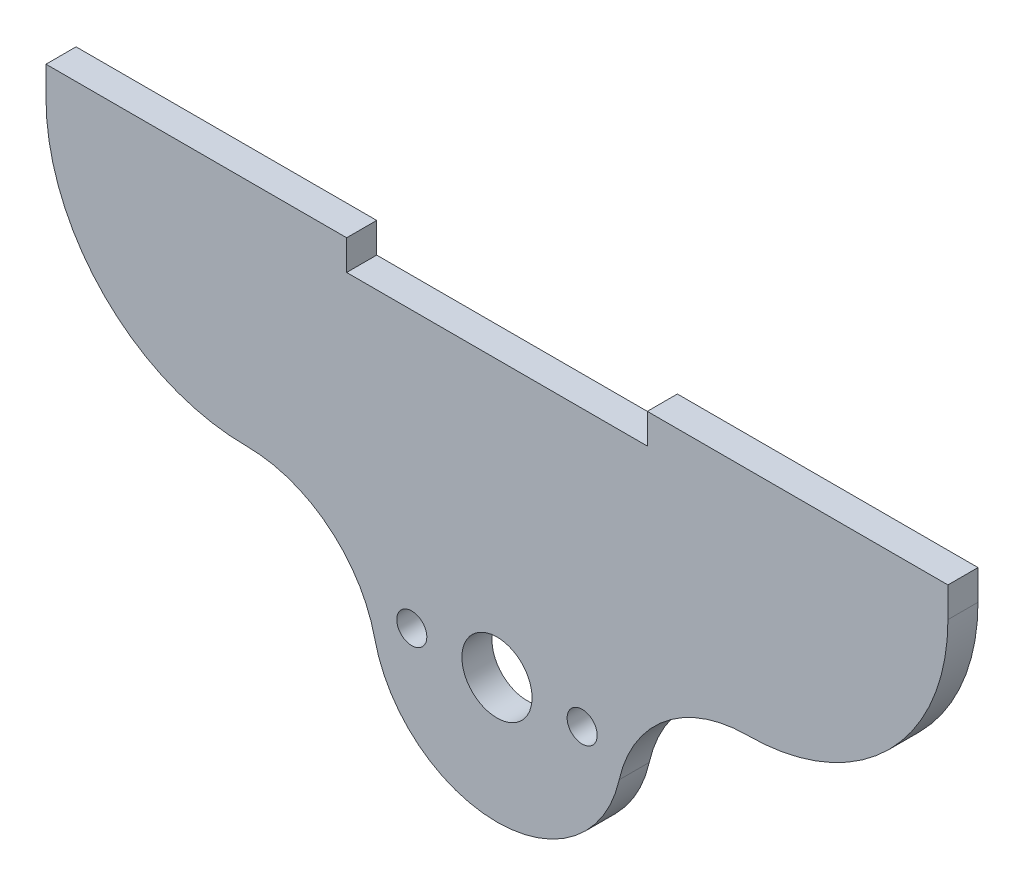
ISO-10303-21;
HEADER;
FILE_DESCRIPTION(('STEP AP214'),'2;1');
FILE_NAME('part.step','',(''),(''),'','','');
FILE_SCHEMA(('AUTOMOTIVE_DESIGN { 1 0 10303 214 1 1 1 1 }'));
ENDSEC;
DATA;
#1=APPLICATION_CONTEXT('core data for automotive mechanical design processes');
#2=APPLICATION_PROTOCOL_DEFINITION('international standard','automotive_design',2000,#1);
#3=PRODUCT_CONTEXT('',#1,'mechanical');
#4=PRODUCT('Part','Part','',(#3));
#5=PRODUCT_RELATED_PRODUCT_CATEGORY('part','',(#4));
#6=PRODUCT_DEFINITION_FORMATION('','',#4);
#7=PRODUCT_DEFINITION_CONTEXT('part definition',#1,'design');
#8=PRODUCT_DEFINITION('design','',#6,#7);
#9=PRODUCT_DEFINITION_SHAPE('','',#8);
#10=(LENGTH_UNIT() NAMED_UNIT(*) SI_UNIT(.MILLI.,.METRE.));
#11=(NAMED_UNIT(*) PLANE_ANGLE_UNIT() SI_UNIT($,.RADIAN.));
#12=(NAMED_UNIT(*) SI_UNIT($,.STERADIAN.) SOLID_ANGLE_UNIT());
#13=UNCERTAINTY_MEASURE_WITH_UNIT(LENGTH_MEASURE(1.E-05),#10,'distance_accuracy_value','');
#14=(GEOMETRIC_REPRESENTATION_CONTEXT(3) GLOBAL_UNCERTAINTY_ASSIGNED_CONTEXT((#13)) GLOBAL_UNIT_ASSIGNED_CONTEXT((#10,
#11,#12)) REPRESENTATION_CONTEXT('',''));
#15=CARTESIAN_POINT('',(0.,0.,0.));
#16=DIRECTION('',(0.,0.,1.));
#17=DIRECTION('',(1.,0.,0.));
#18=AXIS2_PLACEMENT_3D('',#15,#16,#17);
#19=CARTESIAN_POINT('',(-25.,27.5,3.));
#20=DIRECTION('',(0.,0.,1.));
#21=DIRECTION('',(1.,0.,0.));
#22=AXIS2_PLACEMENT_3D('',#19,#20,#21);
#23=PLANE('',#22);
#24=CARTESIAN_POINT('',(8.5,0.,3.));
#25=DIRECTION('',(0.,0.,1.));
#26=DIRECTION('',(1.,0.,0.));
#27=AXIS2_PLACEMENT_3D('',#24,#25,#26);
#28=CIRCLE('',#27,1.5);
#29=CARTESIAN_POINT('',(10.,0.,3.));
#30=VERTEX_POINT('',#29);
#31=EDGE_CURVE('E296',#30,#30,#28,.T.);
#32=ORIENTED_EDGE('',*,*,#31,.F.);
#33=EDGE_LOOP('',(#32));
#34=FACE_BOUND('',#33,.T.);
#35=CARTESIAN_POINT('',(-25.,27.5,3.));
#36=DIRECTION('',(0.,0.,1.));
#37=DIRECTION('',(1.,0.,0.));
#38=AXIS2_PLACEMENT_3D('',#35,#36,#37);
#39=CIRCLE('',#38,20.);
#40=CARTESIAN_POINT('',(-45.,27.5,3.));
#41=VERTEX_POINT('',#40);
#42=CARTESIAN_POINT('',(-25.,7.5,3.));
#43=VERTEX_POINT('',#42);
#44=EDGE_CURVE('E187',#41,#43,#39,.T.);
#45=ORIENTED_EDGE('',*,*,#44,.T.);
#46=CARTESIAN_POINT('',(-25.,-5.625,3.));
#47=DIRECTION('',(0.,0.,-1.));
#48=DIRECTION('',(1.,0.,0.));
#49=AXIS2_PLACEMENT_3D('',#46,#47,#48);
#50=CIRCLE('',#49,13.125);
#51=CARTESIAN_POINT('',(-12.1951219512195,-2.74390243902439,3.));
#52=VERTEX_POINT('',#51);
#53=EDGE_CURVE('E115',#43,#52,#50,.T.);
#54=ORIENTED_EDGE('',*,*,#53,.T.);
#55=CARTESIAN_POINT('',(0.,0.,3.));
#56=DIRECTION('',(0.,0.,1.));
#57=DIRECTION('',(1.,0.,0.));
#58=AXIS2_PLACEMENT_3D('',#55,#56,#57);
#59=CIRCLE('',#58,12.5);
#60=CARTESIAN_POINT('',(12.1951219512195,-2.74390243902439,3.));
#61=VERTEX_POINT('',#60);
#62=EDGE_CURVE('E214',#52,#61,#59,.T.);
#63=ORIENTED_EDGE('',*,*,#62,.T.);
#64=CARTESIAN_POINT('',(25.,-5.625,3.));
#65=DIRECTION('',(0.,0.,-1.));
#66=DIRECTION('',(-1.,0.,0.));
#67=AXIS2_PLACEMENT_3D('',#64,#65,#66);
#68=CIRCLE('',#67,13.125);
#69=CARTESIAN_POINT('',(25.,7.5,3.));
#70=VERTEX_POINT('',#69);
#71=EDGE_CURVE('E233',#61,#70,#68,.T.);
#72=ORIENTED_EDGE('',*,*,#71,.T.);
#73=CARTESIAN_POINT('',(25.,27.5,3.));
#74=DIRECTION('',(0.,0.,1.));
#75=DIRECTION('',(1.,0.,0.));
#76=AXIS2_PLACEMENT_3D('',#73,#74,#75);
#77=CIRCLE('',#76,20.);
#78=CARTESIAN_POINT('',(45.,27.5,3.));
#79=VERTEX_POINT('',#78);
#80=EDGE_CURVE('E230',#70,#79,#77,.T.);
#81=ORIENTED_EDGE('',*,*,#80,.T.);
#82=DIRECTION('',(0.,1.,0.));
#83=VECTOR('',#82,1.);
#84=CARTESIAN_POINT('',(45.,27.5,3.));
#85=LINE('',#84,#83);
#86=CARTESIAN_POINT('',(45.,30.5,3.));
#87=VERTEX_POINT('',#86);
#88=EDGE_CURVE('E232',#79,#87,#85,.T.);
#89=ORIENTED_EDGE('',*,*,#88,.T.);
#90=DIRECTION('',(-1.,0.,0.));
#91=VECTOR('',#90,1.);
#92=CARTESIAN_POINT('',(45.,30.5,3.));
#93=LINE('',#92,#91);
#94=CARTESIAN_POINT('',(15.,30.5,3.));
#95=VERTEX_POINT('',#94);
#96=EDGE_CURVE('E235',#87,#95,#93,.T.);
#97=ORIENTED_EDGE('',*,*,#96,.T.);
#98=DIRECTION('',(0.,-1.,0.));
#99=VECTOR('',#98,1.);
#100=CARTESIAN_POINT('',(15.,27.5,3.));
#101=LINE('',#100,#99);
#102=CARTESIAN_POINT('',(15.,27.5,3.));
#103=VERTEX_POINT('',#102);
#104=EDGE_CURVE('E241',#95,#103,#101,.T.);
#105=ORIENTED_EDGE('',*,*,#104,.T.);
#106=DIRECTION('',(-1.,0.,0.));
#107=VECTOR('',#106,1.);
#108=CARTESIAN_POINT('',(-15.,27.5,3.));
#109=LINE('',#108,#107);
#110=CARTESIAN_POINT('',(-15.,27.5,3.));
#111=VERTEX_POINT('',#110);
#112=EDGE_CURVE('E146',#103,#111,#109,.T.);
#113=ORIENTED_EDGE('',*,*,#112,.T.);
#114=DIRECTION('',(0.,1.,0.));
#115=VECTOR('',#114,1.);
#116=CARTESIAN_POINT('',(-15.,27.5,3.));
#117=LINE('',#116,#115);
#118=CARTESIAN_POINT('',(-15.,30.5,3.));
#119=VERTEX_POINT('',#118);
#120=EDGE_CURVE('E140',#111,#119,#117,.T.);
#121=ORIENTED_EDGE('',*,*,#120,.T.);
#122=DIRECTION('',(-1.,0.,0.));
#123=VECTOR('',#122,1.);
#124=CARTESIAN_POINT('',(-45.,30.5,3.));
#125=LINE('',#124,#123);
#126=CARTESIAN_POINT('',(-45.,30.5,3.));
#127=VERTEX_POINT('',#126);
#128=EDGE_CURVE('E144',#119,#127,#125,.T.);
#129=ORIENTED_EDGE('',*,*,#128,.T.);
#130=DIRECTION('',(0.,-1.,0.));
#131=VECTOR('',#130,1.);
#132=CARTESIAN_POINT('',(-45.,27.5,3.));
#133=LINE('',#132,#131);
#134=EDGE_CURVE('E60',#127,#41,#133,.T.);
#135=ORIENTED_EDGE('',*,*,#134,.T.);
#136=EDGE_LOOP('',(#45,#54,#63,#72,#81,#89,#97,#105,#113,#121,#129,#135));
#137=FACE_BOUND('',#136,.T.);
#138=CARTESIAN_POINT('',(-8.5,0.,3.));
#139=DIRECTION('',(0.,0.,1.));
#140=DIRECTION('',(1.,0.,0.));
#141=AXIS2_PLACEMENT_3D('',#138,#139,#140);
#142=CIRCLE('',#141,1.5);
#143=CARTESIAN_POINT('',(-7.,0.,3.));
#144=VERTEX_POINT('',#143);
#145=EDGE_CURVE('E168',#144,#144,#142,.T.);
#146=ORIENTED_EDGE('',*,*,#145,.F.);
#147=EDGE_LOOP('',(#146));
#148=FACE_BOUND('',#147,.T.);
#149=CARTESIAN_POINT('',(0.,0.,3.));
#150=DIRECTION('',(0.,0.,1.));
#151=DIRECTION('',(1.,0.,0.));
#152=AXIS2_PLACEMENT_3D('',#149,#150,#151);
#153=CIRCLE('',#152,3.5);
#154=CARTESIAN_POINT('',(3.5,0.,3.));
#155=VERTEX_POINT('',#154);
#156=EDGE_CURVE('E287',#155,#155,#153,.T.);
#157=ORIENTED_EDGE('',*,*,#156,.F.);
#158=EDGE_LOOP('',(#157));
#159=FACE_BOUND('',#158,.T.);
#160=ADVANCED_FACE('F43',(#34,#137,#148,#159),#23,.T.);
#161=CARTESIAN_POINT('',(-25.,27.5,0.));
#162=DIRECTION('',(0.,0.,1.));
#163=DIRECTION('',(1.,0.,0.));
#164=AXIS2_PLACEMENT_3D('',#161,#162,#163);
#165=PLANE('',#164);
#166=CARTESIAN_POINT('',(-25.,27.5,0.));
#167=DIRECTION('',(0.,0.,1.));
#168=DIRECTION('',(1.,0.,0.));
#169=AXIS2_PLACEMENT_3D('',#166,#167,#168);
#170=CIRCLE('',#169,20.);
#171=CARTESIAN_POINT('',(-45.,27.5,0.));
#172=VERTEX_POINT('',#171);
#173=CARTESIAN_POINT('',(-25.,7.5,0.));
#174=VERTEX_POINT('',#173);
#175=EDGE_CURVE('E164',#172,#174,#170,.T.);
#176=ORIENTED_EDGE('',*,*,#175,.F.);
#177=DIRECTION('',(0.,-1.,0.));
#178=VECTOR('',#177,1.);
#179=CARTESIAN_POINT('',(-45.,27.5,0.));
#180=LINE('',#179,#178);
#181=CARTESIAN_POINT('',(-45.,30.5,0.));
#182=VERTEX_POINT('',#181);
#183=EDGE_CURVE('E107',#182,#172,#180,.T.);
#184=ORIENTED_EDGE('',*,*,#183,.F.);
#185=DIRECTION('',(-1.,0.,0.));
#186=VECTOR('',#185,1.);
#187=CARTESIAN_POINT('',(-45.,30.5,0.));
#188=LINE('',#187,#186);
#189=CARTESIAN_POINT('',(-15.,30.5,0.));
#190=VERTEX_POINT('',#189);
#191=EDGE_CURVE('E101',#190,#182,#188,.T.);
#192=ORIENTED_EDGE('',*,*,#191,.F.);
#193=DIRECTION('',(0.,1.,0.));
#194=VECTOR('',#193,1.);
#195=CARTESIAN_POINT('',(-15.,27.5,0.));
#196=LINE('',#195,#194);
#197=CARTESIAN_POINT('',(-15.,27.5,0.));
#198=VERTEX_POINT('',#197);
#199=EDGE_CURVE('E154',#198,#190,#196,.T.);
#200=ORIENTED_EDGE('',*,*,#199,.F.);
#201=DIRECTION('',(-1.,0.,0.));
#202=VECTOR('',#201,1.);
#203=CARTESIAN_POINT('',(-15.,27.5,0.));
#204=LINE('',#203,#202);
#205=CARTESIAN_POINT('',(15.,27.5,0.));
#206=VERTEX_POINT('',#205);
#207=EDGE_CURVE('E182',#206,#198,#204,.T.);
#208=ORIENTED_EDGE('',*,*,#207,.F.);
#209=DIRECTION('',(0.,-1.,0.));
#210=VECTOR('',#209,1.);
#211=CARTESIAN_POINT('',(15.,27.5,0.));
#212=LINE('',#211,#210);
#213=CARTESIAN_POINT('',(15.,30.5,0.));
#214=VERTEX_POINT('',#213);
#215=EDGE_CURVE('E180',#214,#206,#212,.T.);
#216=ORIENTED_EDGE('',*,*,#215,.F.);
#217=DIRECTION('',(-1.,0.,0.));
#218=VECTOR('',#217,1.);
#219=CARTESIAN_POINT('',(45.,30.5,0.));
#220=LINE('',#219,#218);
#221=CARTESIAN_POINT('',(45.,30.5,0.));
#222=VERTEX_POINT('',#221);
#223=EDGE_CURVE('E178',#222,#214,#220,.T.);
#224=ORIENTED_EDGE('',*,*,#223,.F.);
#225=DIRECTION('',(0.,1.,0.));
#226=VECTOR('',#225,1.);
#227=CARTESIAN_POINT('',(45.,27.5,0.));
#228=LINE('',#227,#226);
#229=CARTESIAN_POINT('',(45.,27.5,0.));
#230=VERTEX_POINT('',#229);
#231=EDGE_CURVE('E176',#230,#222,#228,.T.);
#232=ORIENTED_EDGE('',*,*,#231,.F.);
#233=CARTESIAN_POINT('',(25.,27.5,0.));
#234=DIRECTION('',(0.,0.,1.));
#235=DIRECTION('',(1.,0.,0.));
#236=AXIS2_PLACEMENT_3D('',#233,#234,#235);
#237=CIRCLE('',#236,20.);
#238=CARTESIAN_POINT('',(25.,7.5,0.));
#239=VERTEX_POINT('',#238);
#240=EDGE_CURVE('E174',#239,#230,#237,.T.);
#241=ORIENTED_EDGE('',*,*,#240,.F.);
#242=CARTESIAN_POINT('',(25.,-5.625,0.));
#243=DIRECTION('',(0.,0.,-1.));
#244=DIRECTION('',(-1.,0.,0.));
#245=AXIS2_PLACEMENT_3D('',#242,#243,#244);
#246=CIRCLE('',#245,13.125);
#247=CARTESIAN_POINT('',(12.1951219512195,-2.74390243902439,0.));
#248=VERTEX_POINT('',#247);
#249=EDGE_CURVE('E172',#248,#239,#246,.T.);
#250=ORIENTED_EDGE('',*,*,#249,.F.);
#251=CARTESIAN_POINT('',(0.,0.,0.));
#252=DIRECTION('',(0.,0.,1.));
#253=DIRECTION('',(1.,0.,0.));
#254=AXIS2_PLACEMENT_3D('',#251,#252,#253);
#255=CIRCLE('',#254,12.5);
#256=CARTESIAN_POINT('',(-12.1951219512195,-2.74390243902439,0.));
#257=VERTEX_POINT('',#256);
#258=EDGE_CURVE('E170',#257,#248,#255,.T.);
#259=ORIENTED_EDGE('',*,*,#258,.F.);
#260=CARTESIAN_POINT('',(-25.,-5.625,0.));
#261=DIRECTION('',(0.,0.,-1.));
#262=DIRECTION('',(1.,0.,0.));
#263=AXIS2_PLACEMENT_3D('',#260,#261,#262);
#264=CIRCLE('',#263,13.125);
#265=EDGE_CURVE('E167',#174,#257,#264,.T.);
#266=ORIENTED_EDGE('',*,*,#265,.F.);
#267=EDGE_LOOP('',(#176,#184,#192,#200,#208,#216,#224,#232,#241,#250,#259,#266));
#268=FACE_BOUND('',#267,.T.);
#269=CARTESIAN_POINT('',(-8.5,0.,0.));
#270=DIRECTION('',(0.,0.,1.));
#271=DIRECTION('',(1.,0.,0.));
#272=AXIS2_PLACEMENT_3D('',#269,#270,#271);
#273=CIRCLE('',#272,1.5);
#274=CARTESIAN_POINT('',(-7.,0.,0.));
#275=VERTEX_POINT('',#274);
#276=EDGE_CURVE('E299',#275,#275,#273,.T.);
#277=ORIENTED_EDGE('',*,*,#276,.T.);
#278=EDGE_LOOP('',(#277));
#279=FACE_BOUND('',#278,.T.);
#280=CARTESIAN_POINT('',(8.5,0.,0.));
#281=DIRECTION('',(0.,0.,1.));
#282=DIRECTION('',(1.,0.,0.));
#283=AXIS2_PLACEMENT_3D('',#280,#281,#282);
#284=CIRCLE('',#283,1.5);
#285=CARTESIAN_POINT('',(10.,0.,0.));
#286=VERTEX_POINT('',#285);
#287=EDGE_CURVE('E293',#286,#286,#284,.T.);
#288=ORIENTED_EDGE('',*,*,#287,.T.);
#289=EDGE_LOOP('',(#288));
#290=FACE_BOUND('',#289,.T.);
#291=CARTESIAN_POINT('',(0.,0.,0.));
#292=DIRECTION('',(0.,0.,1.));
#293=DIRECTION('',(1.,0.,0.));
#294=AXIS2_PLACEMENT_3D('',#291,#292,#293);
#295=CIRCLE('',#294,3.5);
#296=CARTESIAN_POINT('',(3.5,0.,0.));
#297=VERTEX_POINT('',#296);
#298=EDGE_CURVE('E290',#297,#297,#295,.T.);
#299=ORIENTED_EDGE('',*,*,#298,.T.);
#300=EDGE_LOOP('',(#299));
#301=FACE_BOUND('',#300,.T.);
#302=ADVANCED_FACE('F218',(#268,#279,#290,#301),#165,.F.);
#303=CARTESIAN_POINT('',(-25.,27.5,3.));
#304=DIRECTION('',(0.,0.,-1.));
#305=DIRECTION('',(-1.,0.,0.));
#306=AXIS2_PLACEMENT_3D('',#303,#304,#305);
#307=CYLINDRICAL_SURFACE('',#306,20.);
#308=ORIENTED_EDGE('',*,*,#175,.T.);
#309=DIRECTION('',(0.,0.,-1.));
#310=VECTOR('',#309,1.);
#311=CARTESIAN_POINT('',(-25.,7.5,3.));
#312=LINE('',#311,#310);
#313=EDGE_CURVE('E13',#43,#174,#312,.T.);
#314=ORIENTED_EDGE('',*,*,#313,.F.);
#315=ORIENTED_EDGE('',*,*,#44,.F.);
#316=DIRECTION('',(0.,0.,-1.));
#317=VECTOR('',#316,1.);
#318=CARTESIAN_POINT('',(-45.,27.5,3.));
#319=LINE('',#318,#317);
#320=EDGE_CURVE('E160',#41,#172,#319,.T.);
#321=ORIENTED_EDGE('',*,*,#320,.T.);
#322=EDGE_LOOP('',(#308,#314,#315,#321));
#323=FACE_BOUND('',#322,.T.);
#324=ADVANCED_FACE('F45',(#323),#307,.T.);
#325=CARTESIAN_POINT('',(-25.,-5.625,3.));
#326=DIRECTION('',(0.,0.,-1.));
#327=DIRECTION('',(-1.,0.,0.));
#328=AXIS2_PLACEMENT_3D('',#325,#326,#327);
#329=CYLINDRICAL_SURFACE('',#328,13.125);
#330=ORIENTED_EDGE('',*,*,#265,.T.);
#331=DIRECTION('',(0.,0.,-1.));
#332=VECTOR('',#331,1.);
#333=CARTESIAN_POINT('',(-12.1951219512195,-2.74390243902439,3.));
#334=LINE('',#333,#332);
#335=EDGE_CURVE('E52',#52,#257,#334,.T.);
#336=ORIENTED_EDGE('',*,*,#335,.F.);
#337=ORIENTED_EDGE('',*,*,#53,.F.);
#338=ORIENTED_EDGE('',*,*,#313,.T.);
#339=EDGE_LOOP('',(#330,#336,#337,#338));
#340=FACE_BOUND('',#339,.T.);
#341=ADVANCED_FACE('F401',(#340),#329,.F.);
#342=CARTESIAN_POINT('',(0.,0.,3.));
#343=DIRECTION('',(0.,0.,-1.));
#344=DIRECTION('',(-1.,0.,0.));
#345=AXIS2_PLACEMENT_3D('',#342,#343,#344);
#346=CYLINDRICAL_SURFACE('',#345,12.5);
#347=ORIENTED_EDGE('',*,*,#258,.T.);
#348=DIRECTION('',(0.,0.,-1.));
#349=VECTOR('',#348,1.);
#350=CARTESIAN_POINT('',(12.1951219512195,-2.74390243902439,3.));
#351=LINE('',#350,#349);
#352=EDGE_CURVE('E206',#61,#248,#351,.T.);
#353=ORIENTED_EDGE('',*,*,#352,.F.);
#354=ORIENTED_EDGE('',*,*,#62,.F.);
#355=ORIENTED_EDGE('',*,*,#335,.T.);
#356=EDGE_LOOP('',(#347,#353,#354,#355));
#357=FACE_BOUND('',#356,.T.);
#358=ADVANCED_FACE('F212',(#357),#346,.T.);
#359=CARTESIAN_POINT('',(25.,-5.625,3.));
#360=DIRECTION('',(0.,0.,-1.));
#361=DIRECTION('',(-1.,0.,0.));
#362=AXIS2_PLACEMENT_3D('',#359,#360,#361);
#363=CYLINDRICAL_SURFACE('',#362,13.125);
#364=ORIENTED_EDGE('',*,*,#249,.T.);
#365=DIRECTION('',(0.,0.,-1.));
#366=VECTOR('',#365,1.);
#367=CARTESIAN_POINT('',(25.,7.5,3.));
#368=LINE('',#367,#366);
#369=EDGE_CURVE('E203',#70,#239,#368,.T.);
#370=ORIENTED_EDGE('',*,*,#369,.F.);
#371=ORIENTED_EDGE('',*,*,#71,.F.);
#372=ORIENTED_EDGE('',*,*,#352,.T.);
#373=EDGE_LOOP('',(#364,#370,#371,#372));
#374=FACE_BOUND('',#373,.T.);
#375=ADVANCED_FACE('F224',(#374),#363,.F.);
#376=CARTESIAN_POINT('',(25.,27.5,3.));
#377=DIRECTION('',(0.,0.,-1.));
#378=DIRECTION('',(-1.,0.,0.));
#379=AXIS2_PLACEMENT_3D('',#376,#377,#378);
#380=CYLINDRICAL_SURFACE('',#379,20.);
#381=ORIENTED_EDGE('',*,*,#240,.T.);
#382=DIRECTION('',(0.,0.,-1.));
#383=VECTOR('',#382,1.);
#384=CARTESIAN_POINT('',(45.,27.5,3.));
#385=LINE('',#384,#383);
#386=EDGE_CURVE('E200',#79,#230,#385,.T.);
#387=ORIENTED_EDGE('',*,*,#386,.F.);
#388=ORIENTED_EDGE('',*,*,#80,.F.);
#389=ORIENTED_EDGE('',*,*,#369,.T.);
#390=EDGE_LOOP('',(#381,#387,#388,#389));
#391=FACE_BOUND('',#390,.T.);
#392=ADVANCED_FACE('F228',(#391),#380,.T.);
#393=CARTESIAN_POINT('',(45.,27.5,3.));
#394=DIRECTION('',(-1.,0.,0.));
#395=DIRECTION('',(0.,0.,1.));
#396=AXIS2_PLACEMENT_3D('',#393,#394,#395);
#397=PLANE('',#396);
#398=ORIENTED_EDGE('',*,*,#231,.T.);
#399=DIRECTION('',(0.,0.,-1.));
#400=VECTOR('',#399,1.);
#401=CARTESIAN_POINT('',(45.,30.5,3.));
#402=LINE('',#401,#400);
#403=EDGE_CURVE('E197',#87,#222,#402,.T.);
#404=ORIENTED_EDGE('',*,*,#403,.F.);
#405=ORIENTED_EDGE('',*,*,#88,.F.);
#406=ORIENTED_EDGE('',*,*,#386,.T.);
#407=EDGE_LOOP('',(#398,#404,#405,#406));
#408=FACE_BOUND('',#407,.T.);
#409=ADVANCED_FACE('F366',(#408),#397,.F.);
#410=CARTESIAN_POINT('',(45.,30.5,3.));
#411=DIRECTION('',(0.,-1.,0.));
#412=DIRECTION('',(0.,0.,-1.));
#413=AXIS2_PLACEMENT_3D('',#410,#411,#412);
#414=PLANE('',#413);
#415=ORIENTED_EDGE('',*,*,#223,.T.);
#416=DIRECTION('',(0.,0.,-1.));
#417=VECTOR('',#416,1.);
#418=CARTESIAN_POINT('',(15.,30.5,3.));
#419=LINE('',#418,#417);
#420=EDGE_CURVE('E194',#95,#214,#419,.T.);
#421=ORIENTED_EDGE('',*,*,#420,.F.);
#422=ORIENTED_EDGE('',*,*,#96,.F.);
#423=ORIENTED_EDGE('',*,*,#403,.T.);
#424=EDGE_LOOP('',(#415,#421,#422,#423));
#425=FACE_BOUND('',#424,.T.);
#426=ADVANCED_FACE('F357',(#425),#414,.F.);
#427=CARTESIAN_POINT('',(15.,27.5,3.));
#428=DIRECTION('',(1.,0.,0.));
#429=DIRECTION('',(0.,0.,-1.));
#430=AXIS2_PLACEMENT_3D('',#427,#428,#429);
#431=PLANE('',#430);
#432=ORIENTED_EDGE('',*,*,#215,.T.);
#433=DIRECTION('',(0.,0.,-1.));
#434=VECTOR('',#433,1.);
#435=CARTESIAN_POINT('',(15.,27.5,3.));
#436=LINE('',#435,#434);
#437=EDGE_CURVE('E191',#103,#206,#436,.T.);
#438=ORIENTED_EDGE('',*,*,#437,.F.);
#439=ORIENTED_EDGE('',*,*,#104,.F.);
#440=ORIENTED_EDGE('',*,*,#420,.T.);
#441=EDGE_LOOP('',(#432,#438,#439,#440));
#442=FACE_BOUND('',#441,.T.);
#443=ADVANCED_FACE('F247',(#442),#431,.F.);
#444=CARTESIAN_POINT('',(-15.,27.5,3.));
#445=DIRECTION('',(0.,-1.,0.));
#446=DIRECTION('',(0.,0.,-1.));
#447=AXIS2_PLACEMENT_3D('',#444,#445,#446);
#448=PLANE('',#447);
#449=ORIENTED_EDGE('',*,*,#207,.T.);
#450=DIRECTION('',(0.,0.,-1.));
#451=VECTOR('',#450,1.);
#452=CARTESIAN_POINT('',(-15.,27.5,3.));
#453=LINE('',#452,#451);
#454=EDGE_CURVE('E155',#111,#198,#453,.T.);
#455=ORIENTED_EDGE('',*,*,#454,.F.);
#456=ORIENTED_EDGE('',*,*,#112,.F.);
#457=ORIENTED_EDGE('',*,*,#437,.T.);
#458=EDGE_LOOP('',(#449,#455,#456,#457));
#459=FACE_BOUND('',#458,.T.);
#460=ADVANCED_FACE('F251',(#459),#448,.F.);
#461=CARTESIAN_POINT('',(-15.,27.5,3.));
#462=DIRECTION('',(-1.,0.,0.));
#463=DIRECTION('',(0.,0.,1.));
#464=AXIS2_PLACEMENT_3D('',#461,#462,#463);
#465=PLANE('',#464);
#466=ORIENTED_EDGE('',*,*,#199,.T.);
#467=DIRECTION('',(0.,0.,-1.));
#468=VECTOR('',#467,1.);
#469=CARTESIAN_POINT('',(-15.,30.5,3.));
#470=LINE('',#469,#468);
#471=EDGE_CURVE('E151',#119,#190,#470,.T.);
#472=ORIENTED_EDGE('',*,*,#471,.F.);
#473=ORIENTED_EDGE('',*,*,#120,.F.);
#474=ORIENTED_EDGE('',*,*,#454,.T.);
#475=EDGE_LOOP('',(#466,#472,#473,#474));
#476=FACE_BOUND('',#475,.T.);
#477=ADVANCED_FACE('F152',(#476),#465,.F.);
#478=CARTESIAN_POINT('',(-45.,30.5,3.));
#479=DIRECTION('',(0.,-1.,0.));
#480=DIRECTION('',(0.,0.,-1.));
#481=AXIS2_PLACEMENT_3D('',#478,#479,#480);
#482=PLANE('',#481);
#483=ORIENTED_EDGE('',*,*,#191,.T.);
#484=DIRECTION('',(0.,0.,-1.));
#485=VECTOR('',#484,1.);
#486=CARTESIAN_POINT('',(-45.,30.5,3.));
#487=LINE('',#486,#485);
#488=EDGE_CURVE('E156',#127,#182,#487,.T.);
#489=ORIENTED_EDGE('',*,*,#488,.F.);
#490=ORIENTED_EDGE('',*,*,#128,.F.);
#491=ORIENTED_EDGE('',*,*,#471,.T.);
#492=EDGE_LOOP('',(#483,#489,#490,#491));
#493=FACE_BOUND('',#492,.T.);
#494=ADVANCED_FACE('F158',(#493),#482,.F.);
#495=CARTESIAN_POINT('',(-45.,27.5,3.));
#496=DIRECTION('',(1.,0.,0.));
#497=DIRECTION('',(0.,0.,-1.));
#498=AXIS2_PLACEMENT_3D('',#495,#496,#497);
#499=PLANE('',#498);
#500=ORIENTED_EDGE('',*,*,#183,.T.);
#501=ORIENTED_EDGE('',*,*,#320,.F.);
#502=ORIENTED_EDGE('',*,*,#134,.F.);
#503=ORIENTED_EDGE('',*,*,#488,.T.);
#504=EDGE_LOOP('',(#500,#501,#502,#503));
#505=FACE_BOUND('',#504,.T.);
#506=ADVANCED_FACE('F255',(#505),#499,.F.);
#507=CARTESIAN_POINT('',(-8.5,0.,3.));
#508=DIRECTION('',(0.,0.,-1.));
#509=DIRECTION('',(-1.,0.,0.));
#510=AXIS2_PLACEMENT_3D('',#507,#508,#509);
#511=CYLINDRICAL_SURFACE('',#510,1.5);
#512=ORIENTED_EDGE('',*,*,#145,.T.);
#513=EDGE_LOOP('',(#512));
#514=FACE_BOUND('',#513,.T.);
#515=ORIENTED_EDGE('',*,*,#276,.F.);
#516=EDGE_LOOP('',(#515));
#517=FACE_BOUND('',#516,.T.);
#518=ADVANCED_FACE('F257',(#514,#517),#511,.F.);
#519=CARTESIAN_POINT('',(8.5,0.,3.));
#520=DIRECTION('',(0.,0.,-1.));
#521=DIRECTION('',(-1.,0.,0.));
#522=AXIS2_PLACEMENT_3D('',#519,#520,#521);
#523=CYLINDRICAL_SURFACE('',#522,1.5);
#524=ORIENTED_EDGE('',*,*,#31,.T.);
#525=EDGE_LOOP('',(#524));
#526=FACE_BOUND('',#525,.T.);
#527=ORIENTED_EDGE('',*,*,#287,.F.);
#528=EDGE_LOOP('',(#527));
#529=FACE_BOUND('',#528,.T.);
#530=ADVANCED_FACE('F263',(#526,#529),#523,.F.);
#531=CARTESIAN_POINT('',(0.,0.,3.));
#532=DIRECTION('',(0.,0.,-1.));
#533=DIRECTION('',(-1.,0.,0.));
#534=AXIS2_PLACEMENT_3D('',#531,#532,#533);
#535=CYLINDRICAL_SURFACE('',#534,3.5);
#536=ORIENTED_EDGE('',*,*,#156,.T.);
#537=EDGE_LOOP('',(#536));
#538=FACE_BOUND('',#537,.T.);
#539=ORIENTED_EDGE('',*,*,#298,.F.);
#540=EDGE_LOOP('',(#539));
#541=FACE_BOUND('',#540,.T.);
#542=ADVANCED_FACE('F278',(#538,#541),#535,.F.);
#543=CLOSED_SHELL('',(#160,#302,#324,#341,#358,#375,#392,#409,#426,#443,#460,#477,#494,#506,
#518,#530,#542));
#544=MANIFOLD_SOLID_BREP('B2',#543);
#545=ADVANCED_BREP_SHAPE_REPRESENTATION('',(#18,#544),#14);
#546=SHAPE_DEFINITION_REPRESENTATION(#9,#545);
ENDSEC;
END-ISO-10303-21;
